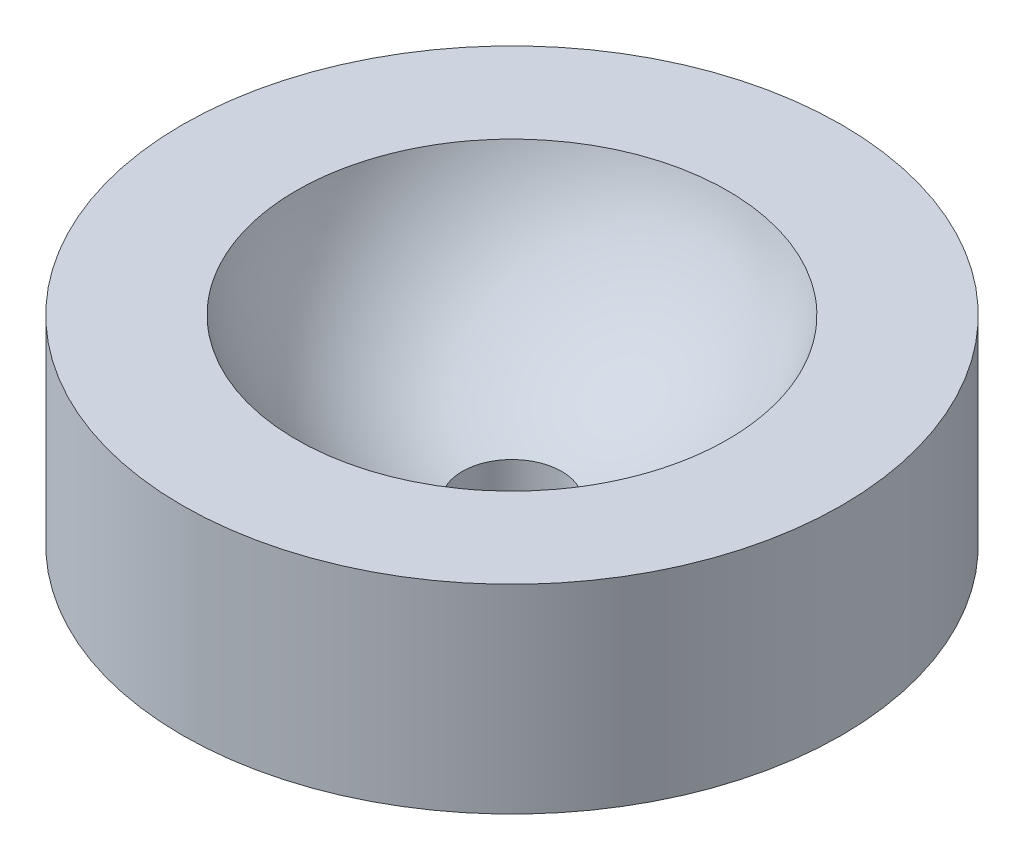
ISO-10303-21;
HEADER;
FILE_DESCRIPTION(('STEP AP214'),'2;1');
FILE_NAME('part.step','',(''),(''),'','','');
FILE_SCHEMA(('AUTOMOTIVE_DESIGN { 1 0 10303 214 1 1 1 1 }'));
ENDSEC;
DATA;
#1=APPLICATION_CONTEXT('core data for automotive mechanical design processes');
#2=APPLICATION_PROTOCOL_DEFINITION('international standard','automotive_design',2000,#1);
#3=PRODUCT_CONTEXT('',#1,'mechanical');
#4=PRODUCT('Part','Part','',(#3));
#5=PRODUCT_RELATED_PRODUCT_CATEGORY('part','',(#4));
#6=PRODUCT_DEFINITION_FORMATION('','',#4);
#7=PRODUCT_DEFINITION_CONTEXT('part definition',#1,'design');
#8=PRODUCT_DEFINITION('design','',#6,#7);
#9=PRODUCT_DEFINITION_SHAPE('','',#8);
#10=(LENGTH_UNIT() NAMED_UNIT(*) SI_UNIT(.MILLI.,.METRE.));
#11=(NAMED_UNIT(*) PLANE_ANGLE_UNIT() SI_UNIT($,.RADIAN.));
#12=(NAMED_UNIT(*) SI_UNIT($,.STERADIAN.) SOLID_ANGLE_UNIT());
#13=UNCERTAINTY_MEASURE_WITH_UNIT(LENGTH_MEASURE(1.E-05),#10,'distance_accuracy_value','');
#14=(GEOMETRIC_REPRESENTATION_CONTEXT(3) GLOBAL_UNCERTAINTY_ASSIGNED_CONTEXT((#13)) GLOBAL_UNIT_ASSIGNED_CONTEXT((#10,
#11,#12)) REPRESENTATION_CONTEXT('',''));
#15=CARTESIAN_POINT('',(0.,0.,0.));
#16=DIRECTION('',(0.,0.,1.));
#17=DIRECTION('',(1.,0.,0.));
#18=AXIS2_PLACEMENT_3D('',#15,#16,#17);
#19=CARTESIAN_POINT('',(0.,3.,0.));
#20=DIRECTION('',(0.,1.,0.));
#21=DIRECTION('',(0.,0.,1.));
#22=AXIS2_PLACEMENT_3D('',#19,#20,#21);
#23=PLANE('',#22);
#24=CARTESIAN_POINT('',(-3.25,3.,0.));
#25=CARTESIAN_POINT('',(-3.25000071441974,3.,-0.112871241741534));
#26=CARTESIAN_POINT('',(-3.24411288115306,3.,-0.225731969443587));
#27=CARTESIAN_POINT('',(-3.22063774044527,3.,-0.450285354799666));
#28=CARTESIAN_POINT('',(-3.20304256865926,3.00000000000001,-0.561977175984938));
#29=CARTESIAN_POINT('',(-3.1418752801163,3.00000000000002,-0.851109474711555));
#30=CARTESIAN_POINT('',(-3.08897778018415,3.,-1.02666600780109));
#31=CARTESIAN_POINT('',(-2.95441985166643,3.,-1.36652123926224));
#32=CARTESIAN_POINT('',(-2.8727289676246,3.,-1.53080779644346));
#33=CARTESIAN_POINT('',(-2.68294721393602,3.,-1.84327907041719));
#34=CARTESIAN_POINT('',(-2.57486733318678,3.,-1.99147045254001));
#35=CARTESIAN_POINT('',(-2.33538859031032,3.,-2.2675654437202));
#36=CARTESIAN_POINT('',(-2.20399506127217,3.,-2.39547367998184));
#37=CARTESIAN_POINT('',(-1.92158721530847,3.,-2.62743094573952));
#38=CARTESIAN_POINT('',(-1.77057104017823,3.,-2.73147771304393));
#39=CARTESIAN_POINT('',(-1.45320832181769,3.,-2.91274469840322));
#40=CARTESIAN_POINT('',(-1.28686118129645,3.,-2.98996387070158));
#41=CARTESIAN_POINT('',(-0.943566890642209,3.,-3.11537728405178));
#42=CARTESIAN_POINT('',(-0.766619931882069,3.,-3.16357204894697));
#43=CARTESIAN_POINT('',(-0.407146822541757,3.,-3.22957049672463));
#44=CARTESIAN_POINT('',(-0.22462068801425,3.,-3.24737426704111));
#45=CARTESIAN_POINT('',(0.140829998177783,3.,-3.25208564285115));
#46=CARTESIAN_POINT('',(0.323754550069611,3.,-3.23899323071347));
#47=CARTESIAN_POINT('',(0.684809599399814,3.,-3.18228377309154));
#48=CARTESIAN_POINT('',(0.862940088516775,3.,-3.13866667462684));
#49=CARTESIAN_POINT('',(1.20935237574451,3.,-3.02214528018687));
#50=CARTESIAN_POINT('',(1.37763404291748,3.,-2.94924059494123));
#51=CARTESIAN_POINT('',(1.69956442755354,3.,-2.77621568186376));
#52=CARTESIAN_POINT('',(1.85321355926881,3.,-2.67609622480111));
#53=CARTESIAN_POINT('',(2.14151263612147,3.,-2.451492158035));
#54=CARTESIAN_POINT('',(2.27616388887896,3.,-2.3270092266738));
#55=CARTESIAN_POINT('',(2.52267914347355,3.,-2.05717890244385));
#56=CARTESIAN_POINT('',(2.63453935759813,3.,-1.91182804830234));
#57=CARTESIAN_POINT('',(2.83229620268418,3.,-1.60437856796829));
#58=CARTESIAN_POINT('',(2.91818503101773,3.,-1.44227492829484));
#59=CARTESIAN_POINT('',(3.06146629552202,3.,-1.10601275095861));
#60=CARTESIAN_POINT('',(3.11888051148903,3.,-0.931863543311242));
#61=CARTESIAN_POINT('',(3.19072858391091,3.,-0.630793754615228));
#62=CARTESIAN_POINT('',(3.21293005484813,3.,-0.505665428764625));
#63=CARTESIAN_POINT('',(3.24256253890853,3.,-0.253686525081167));
#64=CARTESIAN_POINT('',(3.24999919718622,3.,-0.126836624156886));
#65=CARTESIAN_POINT('',(3.25000071441974,3.,0.112871241741535));
#66=CARTESIAN_POINT('',(3.24411288115306,3.,0.225731969443588));
#67=CARTESIAN_POINT('',(3.22063774044527,3.,0.450285354799667));
#68=CARTESIAN_POINT('',(3.20304256865926,3.00000000000001,0.561977175984939));
#69=CARTESIAN_POINT('',(3.1418752801163,3.00000000000002,0.851109474711556));
#70=CARTESIAN_POINT('',(3.08897778018415,3.,1.02666600780109));
#71=CARTESIAN_POINT('',(2.95441985166643,3.,1.36652123926225));
#72=CARTESIAN_POINT('',(2.8727289676246,3.,1.53080779644346));
#73=CARTESIAN_POINT('',(2.68294721393602,3.,1.84327907041719));
#74=CARTESIAN_POINT('',(2.57486733318678,3.,1.99147045254002));
#75=CARTESIAN_POINT('',(2.33538859031032,3.,2.2675654437202));
#76=CARTESIAN_POINT('',(2.20399506127217,3.,2.39547367998184));
#77=CARTESIAN_POINT('',(1.92158721530847,3.,2.62743094573952));
#78=CARTESIAN_POINT('',(1.77057104017823,3.,2.73147771304393));
#79=CARTESIAN_POINT('',(1.45320832181768,3.,2.91274469840322));
#80=CARTESIAN_POINT('',(1.28686118129644,3.,2.98996387070158));
#81=CARTESIAN_POINT('',(0.943566890642207,3.,3.11537728405178));
#82=CARTESIAN_POINT('',(0.766619931882067,3.,3.16357204894697));
#83=CARTESIAN_POINT('',(0.407146822541755,3.,3.22957049672463));
#84=CARTESIAN_POINT('',(0.224620688014247,3.,3.24737426704111));
#85=CARTESIAN_POINT('',(-0.140829998177786,3.,3.25208564285115));
#86=CARTESIAN_POINT('',(-0.323754550069613,3.,3.23899323071347));
#87=CARTESIAN_POINT('',(-0.684809599399816,3.,3.18228377309154));
#88=CARTESIAN_POINT('',(-0.862940088516777,3.,3.13866667462684));
#89=CARTESIAN_POINT('',(-1.20935237574451,3.,3.02214528018687));
#90=CARTESIAN_POINT('',(-1.37763404291748,3.,2.94924059494123));
#91=CARTESIAN_POINT('',(-1.69956442755354,3.,2.77621568186376));
#92=CARTESIAN_POINT('',(-1.85321355926882,3.,2.67609622480111));
#93=CARTESIAN_POINT('',(-2.14151263612147,3.,2.451492158035));
#94=CARTESIAN_POINT('',(-2.27616388887896,3.,2.32700922667379));
#95=CARTESIAN_POINT('',(-2.52267914347355,3.,2.05717890244384));
#96=CARTESIAN_POINT('',(-2.63453935759813,3.,1.91182804830234));
#97=CARTESIAN_POINT('',(-2.83229620268418,3.,1.60437856796829));
#98=CARTESIAN_POINT('',(-2.91818503101773,3.,1.44227492829484));
#99=CARTESIAN_POINT('',(-3.06146629552202,3.,1.10601275095861));
#100=CARTESIAN_POINT('',(-3.11888051148903,3.,0.93186354331124));
#101=CARTESIAN_POINT('',(-3.19072858391091,3.,0.630793754615227));
#102=CARTESIAN_POINT('',(-3.21293005484813,3.,0.505665428764624));
#103=CARTESIAN_POINT('',(-3.24256253890853,3.,0.253686525081167));
#104=CARTESIAN_POINT('',(-3.24999919718622,3.,0.126836624156886));
#105=CARTESIAN_POINT('',(-3.25,3.,0.));
#106=B_SPLINE_CURVE_WITH_KNOTS('',3,(#24,#25,#26,#27,#28,#29,#30,#31,#32,#33,#34,#35,#36,#37,
#38,#39,#40,#41,#42,#43,#44,#45,#46,#47,#48,#49,#50,#51,#52,#53,#54,#55,#56,#57,#58,#59,#60,#61,
#62,#63,#64,#65,#66,#67,#68,#69,#70,#71,#72,#73,#74,#75,#76,#77,#78,#79,#80,#81,#82,#83,#84,#85,
#86,#87,#88,#89,#90,#91,#92,#93,#94,#95,#96,#97,#98,#99,#100,#101,#102,#103,#104,#105),
.UNSPECIFIED.,.T.,.F.,(4,2,2,2,2,2,2,2,2,2,2,2,2,2,2,2,2,2,2,2,2,2,2,2,2,2,2,2,2,2,2,2,2,2,2,2,
2,2,2,2,4),(0.,0.338429959480198,0.677087487383999,1.22437212026462,1.77223737508838,
2.3198748759759,2.86738726375309,3.41495153711981,3.96253715249193,4.51011288453814,
5.05768704122221,5.6052615103853,6.15283692995329,6.70041962775624,7.24798681869026,
7.79551630228113,8.34313670738272,8.89092147193279,9.43828659558518,9.81873545349552,
10.1990388231733,10.5374687826535,10.8761263105573,11.4234109434379,11.9712761982617,
12.5189136991492,13.0664260869264,13.6139903602931,14.1615759756652,14.7091517077114,
15.2567258643955,15.8043003335586,16.3518757531266,16.8994584509295,17.4470256418636,
17.9945551254544,18.542175530556,19.0899602951061,19.6373254187585,20.0177742766688,
20.3980776463466),.UNSPECIFIED.);
#107=CARTESIAN_POINT('',(-3.25,3.,0.));
#108=VERTEX_POINT('',#107);
#109=EDGE_CURVE('E18',#108,#108,#106,.T.);
#110=ORIENTED_EDGE('',*,*,#109,.T.);
#111=EDGE_LOOP('',(#110));
#112=FACE_BOUND('',#111,.T.);
#113=CARTESIAN_POINT('',(0.,3.,0.));
#114=DIRECTION('',(0.,1.,0.));
#115=DIRECTION('',(0.,0.,1.));
#116=AXIS2_PLACEMENT_3D('',#113,#114,#115);
#117=CIRCLE('',#116,4.97);
#118=CARTESIAN_POINT('',(0.,3.,4.97));
#119=VERTEX_POINT('',#118);
#120=EDGE_CURVE('E35',#119,#119,#117,.F.);
#121=ORIENTED_EDGE('',*,*,#120,.F.);
#122=EDGE_LOOP('',(#121));
#123=FACE_BOUND('',#122,.T.);
#124=ADVANCED_FACE('F14',(#112,#123),#23,.T.);
#125=CARTESIAN_POINT('',(0.,3.8625,0.));
#126=DIRECTION('',(1.,0.,0.));
#127=DIRECTION('',(0.,0.,-1.));
#128=AXIS2_PLACEMENT_3D('',#125,#126,#127);
#129=SPHERICAL_SURFACE('',#128,3.3625);
#130=ORIENTED_EDGE('',*,*,#109,.F.);
#131=EDGE_LOOP('',(#130));
#132=FACE_BOUND('',#131,.T.);
#133=CARTESIAN_POINT('',(0.,0.5847101577435,0.));
#134=DIRECTION('',(0.,-1.,0.));
#135=DIRECTION('',(0.,0.,-1.));
#136=AXIS2_PLACEMENT_3D('',#133,#134,#135);
#137=CIRCLE('',#136,0.75);
#138=CARTESIAN_POINT('',(0.,0.5847101577435,-0.75));
#139=VERTEX_POINT('',#138);
#140=EDGE_CURVE('E29',#139,#139,#137,.T.);
#141=ORIENTED_EDGE('',*,*,#140,.T.);
#142=EDGE_LOOP('',(#141));
#143=FACE_BOUND('',#142,.T.);
#144=ADVANCED_FACE('F44',(#132,#143),#129,.F.);
#145=CARTESIAN_POINT('',(0.,0.,0.));
#146=DIRECTION('',(0.,1.,0.));
#147=DIRECTION('',(0.,0.,1.));
#148=AXIS2_PLACEMENT_3D('',#145,#146,#147);
#149=CYLINDRICAL_SURFACE('',#148,4.97);
#150=ORIENTED_EDGE('',*,*,#120,.T.);
#151=EDGE_LOOP('',(#150));
#152=FACE_BOUND('',#151,.T.);
#153=CARTESIAN_POINT('',(0.,0.,0.));
#154=DIRECTION('',(0.,1.,0.));
#155=DIRECTION('',(0.,0.,1.));
#156=AXIS2_PLACEMENT_3D('',#153,#154,#155);
#157=CIRCLE('',#156,4.97);
#158=CARTESIAN_POINT('',(0.,0.,4.97));
#159=VERTEX_POINT('',#158);
#160=EDGE_CURVE('E24',#159,#159,#157,.T.);
#161=ORIENTED_EDGE('',*,*,#160,.T.);
#162=EDGE_LOOP('',(#161));
#163=FACE_BOUND('',#162,.T.);
#164=ADVANCED_FACE('F47',(#152,#163),#149,.T.);
#165=CARTESIAN_POINT('',(0.,0.,0.));
#166=DIRECTION('',(0.,-1.,0.));
#167=DIRECTION('',(0.,0.,-1.));
#168=AXIS2_PLACEMENT_3D('',#165,#166,#167);
#169=CYLINDRICAL_SURFACE('',#168,0.75);
#170=ORIENTED_EDGE('',*,*,#140,.F.);
#171=EDGE_LOOP('',(#170));
#172=FACE_BOUND('',#171,.T.);
#173=CARTESIAN_POINT('',(0.,0.,0.));
#174=DIRECTION('',(0.,-1.,0.));
#175=DIRECTION('',(0.,0.,-1.));
#176=AXIS2_PLACEMENT_3D('',#173,#174,#175);
#177=CIRCLE('',#176,0.75);
#178=CARTESIAN_POINT('',(0.,0.,-0.75));
#179=VERTEX_POINT('',#178);
#180=EDGE_CURVE('E10',#179,#179,#177,.T.);
#181=ORIENTED_EDGE('',*,*,#180,.T.);
#182=EDGE_LOOP('',(#181));
#183=FACE_BOUND('',#182,.T.);
#184=ADVANCED_FACE('F50',(#172,#183),#169,.F.);
#185=CARTESIAN_POINT('',(0.,0.,0.));
#186=DIRECTION('',(0.,1.,0.));
#187=DIRECTION('',(0.,0.,1.));
#188=AXIS2_PLACEMENT_3D('',#185,#186,#187);
#189=PLANE('',#188);
#190=ORIENTED_EDGE('',*,*,#180,.F.);
#191=EDGE_LOOP('',(#190));
#192=FACE_BOUND('',#191,.T.);
#193=ORIENTED_EDGE('',*,*,#160,.F.);
#194=EDGE_LOOP('',(#193));
#195=FACE_BOUND('',#194,.T.);
#196=ADVANCED_FACE('F52',(#192,#195),#189,.F.);
#197=CLOSED_SHELL('',(#124,#144,#164,#184,#196));
#198=MANIFOLD_SOLID_BREP('B1',#197);
#199=ADVANCED_BREP_SHAPE_REPRESENTATION('',(#18,#198),#14);
#200=SHAPE_DEFINITION_REPRESENTATION(#9,#199);
ENDSEC;
END-ISO-10303-21;
